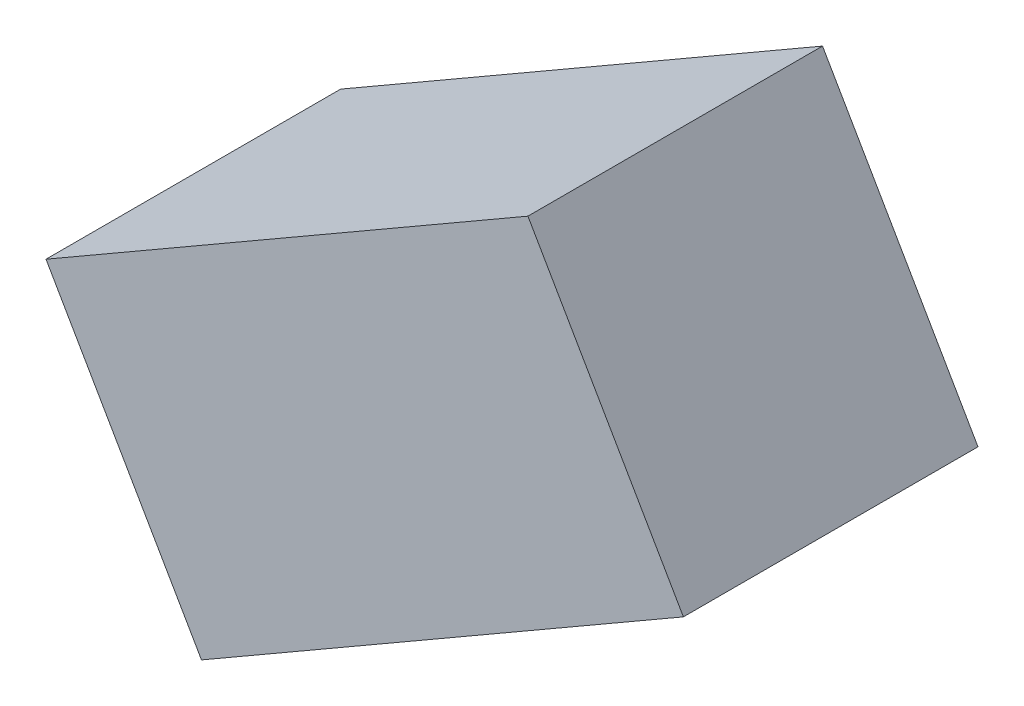
ISO-10303-21;
HEADER;
FILE_DESCRIPTION(('STEP AP214'),'2;1');
FILE_NAME('part.step','',(''),(''),'','','');
FILE_SCHEMA(('AUTOMOTIVE_DESIGN { 1 0 10303 214 1 1 1 1 }'));
ENDSEC;
DATA;
#1=APPLICATION_CONTEXT('core data for automotive mechanical design processes');
#2=APPLICATION_PROTOCOL_DEFINITION('international standard','automotive_design',2000,#1);
#3=PRODUCT_CONTEXT('',#1,'mechanical');
#4=PRODUCT('Part','Part','',(#3));
#5=PRODUCT_RELATED_PRODUCT_CATEGORY('part','',(#4));
#6=PRODUCT_DEFINITION_FORMATION('','',#4);
#7=PRODUCT_DEFINITION_CONTEXT('part definition',#1,'design');
#8=PRODUCT_DEFINITION('design','',#6,#7);
#9=PRODUCT_DEFINITION_SHAPE('','',#8);
#10=(LENGTH_UNIT() NAMED_UNIT(*) SI_UNIT(.MILLI.,.METRE.));
#11=(NAMED_UNIT(*) PLANE_ANGLE_UNIT() SI_UNIT($,.RADIAN.));
#12=(NAMED_UNIT(*) SI_UNIT($,.STERADIAN.) SOLID_ANGLE_UNIT());
#13=UNCERTAINTY_MEASURE_WITH_UNIT(LENGTH_MEASURE(1.E-05),#10,'distance_accuracy_value','');
#14=(GEOMETRIC_REPRESENTATION_CONTEXT(3) GLOBAL_UNCERTAINTY_ASSIGNED_CONTEXT((#13)) GLOBAL_UNIT_ASSIGNED_CONTEXT((#10,
#11,#12)) REPRESENTATION_CONTEXT('',''));
#15=CARTESIAN_POINT('',(0.,0.,0.));
#16=DIRECTION('',(0.,0.,1.));
#17=DIRECTION('',(1.,0.,0.));
#18=AXIS2_PLACEMENT_3D('',#15,#16,#17);
#19=CARTESIAN_POINT('',(-0.49862232,-0.83636104,0.90000074));
#20=DIRECTION('',(0.,0.,-1.));
#21=DIRECTION('',(-1.,0.,0.));
#22=AXIS2_PLACEMENT_3D('',#19,#20,#21);
#23=PLANE('',#22);
#24=DIRECTION('',(0.500000413801082,-0.866025164876141,0.));
#25=VECTOR('',#24,1.);
#26=CARTESIAN_POINT('',(0.97362264,0.01363979999999,0.90000074));
#27=LINE('',#26,#25);
#28=CARTESIAN_POINT('',(0.973622640000073,0.0136397999998627,0.90000074));
#29=VERTEX_POINT('',#28);
#30=CARTESIAN_POINT('',(0.498622320000048,0.836363580000028,0.90000074));
#31=VERTEX_POINT('',#30);
#32=EDGE_CURVE('E55',#29,#31,#27,.F.);
#33=ORIENTED_EDGE('',*,*,#32,.T.);
#34=DIRECTION('',(0.86602507711416,0.500000565809093,0.));
#35=VECTOR('',#34,1.);
#36=CARTESIAN_POINT('',(0.49862232,0.83636358,0.90000074));
#37=LINE('',#36,#35);
#38=CARTESIAN_POINT('',(-0.973620099999994,-0.0136372600000101,0.90000074));
#39=VERTEX_POINT('',#38);
#40=EDGE_CURVE('E57',#31,#39,#37,.F.);
#41=ORIENTED_EDGE('',*,*,#40,.T.);
#42=DIRECTION('',(-0.499998408535102,0.866026322615176,0.));
#43=VECTOR('',#42,1.);
#44=CARTESIAN_POINT('',(-0.9736201,-0.01363726,0.90000074));
#45=LINE('',#44,#43);
#46=CARTESIAN_POINT('',(-0.498622319999909,-0.836361039999947,0.90000074));
#47=VERTEX_POINT('',#46);
#48=EDGE_CURVE('E20',#39,#47,#45,.F.);
#49=ORIENTED_EDGE('',*,*,#48,.T.);
#50=DIRECTION('',(-0.866025450643935,-0.499999918836963,0.));
#51=VECTOR('',#50,1.);
#52=CARTESIAN_POINT('',(-0.49862232,-0.83636104,0.90000074));
#53=LINE('',#52,#51);
#54=EDGE_CURVE('E80',#47,#29,#53,.F.);
#55=ORIENTED_EDGE('',*,*,#54,.T.);
#56=EDGE_LOOP('',(#33,#41,#49,#55));
#57=FACE_BOUND('',#56,.T.);
#58=ADVANCED_FACE('F17',(#57),#23,.F.);
#59=CARTESIAN_POINT('',(-0.9736201,-0.01363726,0.));
#60=DIRECTION('',(0.866026322615176,0.499998408535102,0.));
#61=DIRECTION('',(-0.499998408535102,0.866026322615176,0.));
#62=AXIS2_PLACEMENT_3D('',#59,#60,#61);
#63=PLANE('',#62);
#64=DIRECTION('',(0.,0.,1.));
#65=VECTOR('',#64,1.);
#66=CARTESIAN_POINT('',(-0.49862232,-0.83636104,0.));
#67=LINE('',#66,#65);
#68=CARTESIAN_POINT('',(-0.498622319999909,-0.836361039999947,0.));
#69=VERTEX_POINT('',#68);
#70=EDGE_CURVE('E68',#69,#47,#67,.T.);
#71=ORIENTED_EDGE('',*,*,#70,.T.);
#72=ORIENTED_EDGE('',*,*,#48,.F.);
#73=DIRECTION('',(0.,0.,1.));
#74=VECTOR('',#73,1.);
#75=CARTESIAN_POINT('',(-0.973620099999977,-0.0136372600000406,0.));
#76=LINE('',#75,#74);
#77=CARTESIAN_POINT('',(-0.973620099999994,-0.0136372600000101,0.));
#78=VERTEX_POINT('',#77);
#79=EDGE_CURVE('E63',#39,#78,#76,.F.);
#80=ORIENTED_EDGE('',*,*,#79,.T.);
#81=DIRECTION('',(-0.49999840853491,0.866026322615287,0.));
#82=VECTOR('',#81,1.);
#83=CARTESIAN_POINT('',(-0.49862232,-0.83636104,0.));
#84=LINE('',#83,#82);
#85=EDGE_CURVE('E83',#69,#78,#84,.T.);
#86=ORIENTED_EDGE('',*,*,#85,.F.);
#87=EDGE_LOOP('',(#71,#72,#80,#86));
#88=FACE_BOUND('',#87,.T.);
#89=ADVANCED_FACE('F65',(#88),#63,.F.);
#90=CARTESIAN_POINT('',(0.49862232,0.83636358,0.));
#91=DIRECTION('',(0.500000565809093,-0.86602507711416,0.));
#92=DIRECTION('',(0.86602507711416,0.500000565809093,0.));
#93=AXIS2_PLACEMENT_3D('',#90,#91,#92);
#94=PLANE('',#93);
#95=ORIENTED_EDGE('',*,*,#79,.F.);
#96=ORIENTED_EDGE('',*,*,#40,.F.);
#97=DIRECTION('',(0.,0.,1.));
#98=VECTOR('',#97,1.);
#99=CARTESIAN_POINT('',(0.498622320000195,0.836363580000112,0.));
#100=LINE('',#99,#98);
#101=CARTESIAN_POINT('',(0.498622320000049,0.836363580000028,0.));
#102=VERTEX_POINT('',#101);
#103=EDGE_CURVE('E75',#31,#102,#100,.F.);
#104=ORIENTED_EDGE('',*,*,#103,.T.);
#105=DIRECTION('',(0.866025077114174,0.500000565809069,0.));
#106=VECTOR('',#105,1.);
#107=CARTESIAN_POINT('',(-0.9736201,-0.01363726,0.));
#108=LINE('',#107,#106);
#109=EDGE_CURVE('E72',#78,#102,#108,.T.);
#110=ORIENTED_EDGE('',*,*,#109,.F.);
#111=EDGE_LOOP('',(#95,#96,#104,#110));
#112=FACE_BOUND('',#111,.T.);
#113=ADVANCED_FACE('F70',(#112),#94,.F.);
#114=CARTESIAN_POINT('',(0.97362264,0.01363979999999,0.));
#115=DIRECTION('',(-0.866025164876141,-0.500000413801082,0.));
#116=DIRECTION('',(0.500000413801082,-0.866025164876141,0.));
#117=AXIS2_PLACEMENT_3D('',#114,#115,#116);
#118=PLANE('',#117);
#119=ORIENTED_EDGE('',*,*,#103,.F.);
#120=ORIENTED_EDGE('',*,*,#32,.F.);
#121=DIRECTION('',(0.,0.,1.));
#122=VECTOR('',#121,1.);
#123=CARTESIAN_POINT('',(0.973622640000294,0.0136397999994812,0.));
#124=LINE('',#123,#122);
#125=CARTESIAN_POINT('',(0.973622640000073,0.0136397999998628,0.));
#126=VERTEX_POINT('',#125);
#127=EDGE_CURVE('E35',#29,#126,#124,.F.);
#128=ORIENTED_EDGE('',*,*,#127,.T.);
#129=DIRECTION('',(0.500000413801286,-0.866025164876023,0.));
#130=VECTOR('',#129,1.);
#131=CARTESIAN_POINT('',(0.49862232,0.83636358,0.));
#132=LINE('',#131,#130);
#133=EDGE_CURVE('E26',#102,#126,#132,.T.);
#134=ORIENTED_EDGE('',*,*,#133,.F.);
#135=EDGE_LOOP('',(#119,#120,#128,#134));
#136=FACE_BOUND('',#135,.T.);
#137=ADVANCED_FACE('F89',(#136),#118,.F.);
#138=CARTESIAN_POINT('',(-0.49862232,-0.83636104,0.));
#139=DIRECTION('',(-0.499999918836963,0.866025450643935,0.));
#140=DIRECTION('',(-0.866025450643935,-0.499999918836963,0.));
#141=AXIS2_PLACEMENT_3D('',#138,#139,#140);
#142=PLANE('',#141);
#143=ORIENTED_EDGE('',*,*,#127,.F.);
#144=ORIENTED_EDGE('',*,*,#54,.F.);
#145=ORIENTED_EDGE('',*,*,#70,.F.);
#146=DIRECTION('',(-0.866025450643762,-0.499999918837262,0.));
#147=VECTOR('',#146,1.);
#148=CARTESIAN_POINT('',(0.97362264,0.0136397999999901,0.));
#149=LINE('',#148,#147);
#150=EDGE_CURVE('E11',#126,#69,#149,.T.);
#151=ORIENTED_EDGE('',*,*,#150,.F.);
#152=EDGE_LOOP('',(#143,#144,#145,#151));
#153=FACE_BOUND('',#152,.T.);
#154=ADVANCED_FACE('F91',(#153),#142,.F.);
#155=CARTESIAN_POINT('',(-0.49862232,-0.83636104,0.));
#156=DIRECTION('',(0.,0.,-1.));
#157=DIRECTION('',(-1.,0.,0.));
#158=AXIS2_PLACEMENT_3D('',#155,#156,#157);
#159=PLANE('',#158);
#160=ORIENTED_EDGE('',*,*,#133,.T.);
#161=ORIENTED_EDGE('',*,*,#150,.T.);
#162=ORIENTED_EDGE('',*,*,#85,.T.);
#163=ORIENTED_EDGE('',*,*,#109,.T.);
#164=EDGE_LOOP('',(#160,#161,#162,#163));
#165=FACE_BOUND('',#164,.T.);
#166=ADVANCED_FACE('F88',(#165),#159,.T.);
#167=CLOSED_SHELL('',(#58,#89,#113,#137,#154,#166));
#168=MANIFOLD_SOLID_BREP('B1',#167);
#169=ADVANCED_BREP_SHAPE_REPRESENTATION('',(#18,#168),#14);
#170=SHAPE_DEFINITION_REPRESENTATION(#9,#169);
ENDSEC;
END-ISO-10303-21;
